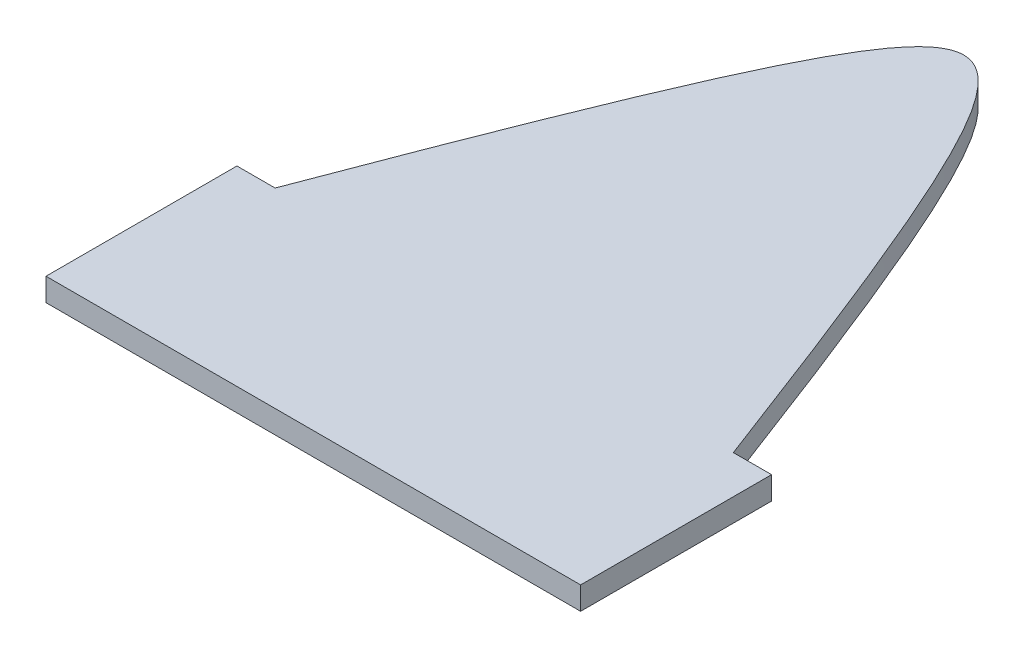
ISO-10303-21;
HEADER;
FILE_DESCRIPTION(('STEP AP214'),'2;1');
FILE_NAME('part.step','',(''),(''),'','','');
FILE_SCHEMA(('AUTOMOTIVE_DESIGN { 1 0 10303 214 1 1 1 1 }'));
ENDSEC;
DATA;
#1=APPLICATION_CONTEXT('core data for automotive mechanical design processes');
#2=APPLICATION_PROTOCOL_DEFINITION('international standard','automotive_design',2000,#1);
#3=PRODUCT_CONTEXT('',#1,'mechanical');
#4=PRODUCT('Part','Part','',(#3));
#5=PRODUCT_RELATED_PRODUCT_CATEGORY('part','',(#4));
#6=PRODUCT_DEFINITION_FORMATION('','',#4);
#7=PRODUCT_DEFINITION_CONTEXT('part definition',#1,'design');
#8=PRODUCT_DEFINITION('design','',#6,#7);
#9=PRODUCT_DEFINITION_SHAPE('','',#8);
#10=(LENGTH_UNIT() NAMED_UNIT(*) SI_UNIT(.MILLI.,.METRE.));
#11=(NAMED_UNIT(*) PLANE_ANGLE_UNIT() SI_UNIT($,.RADIAN.));
#12=(NAMED_UNIT(*) SI_UNIT($,.STERADIAN.) SOLID_ANGLE_UNIT());
#13=UNCERTAINTY_MEASURE_WITH_UNIT(LENGTH_MEASURE(1.E-05),#10,'distance_accuracy_value','');
#14=(GEOMETRIC_REPRESENTATION_CONTEXT(3) GLOBAL_UNCERTAINTY_ASSIGNED_CONTEXT((#13)) GLOBAL_UNIT_ASSIGNED_CONTEXT((#10,
#11,#12)) REPRESENTATION_CONTEXT('',''));
#15=CARTESIAN_POINT('',(0.,0.,0.));
#16=DIRECTION('',(0.,0.,1.));
#17=DIRECTION('',(1.,0.,0.));
#18=AXIS2_PLACEMENT_3D('',#15,#16,#17);
#19=CARTESIAN_POINT('',(30.,-3.,0.));
#20=CARTESIAN_POINT('',(0.,-3.,-79.6774759685465));
#21=CARTESIAN_POINT('',(-30.,-3.,0.));
#22=(BOUNDED_CURVE() B_SPLINE_CURVE(2,(#19,#20,#21),.UNSPECIFIED.,.F.,
.F.) B_SPLINE_CURVE_WITH_KNOTS((3,3),(0.,1.),
.UNSPECIFIED.) CURVE() GEOMETRIC_REPRESENTATION_ITEM() RATIONAL_B_SPLINE_CURVE((1.,
3.08339946566779,1.)) REPRESENTATION_ITEM(''));
#23=DIRECTION('',(0.,1.,0.));
#24=VECTOR('',#23,1.);
#25=SURFACE_OF_LINEAR_EXTRUSION('',#22,#24);
#26=CARTESIAN_POINT('',(30.,0.,0.));
#27=CARTESIAN_POINT('',(0.,0.,-79.6774759685465));
#28=CARTESIAN_POINT('',(-30.,0.,0.));
#29=(BOUNDED_CURVE() B_SPLINE_CURVE(2,(#26,#27,#28),.UNSPECIFIED.,.F.,
.F.) B_SPLINE_CURVE_WITH_KNOTS((3,3),(0.,1.),
.UNSPECIFIED.) CURVE() GEOMETRIC_REPRESENTATION_ITEM() RATIONAL_B_SPLINE_CURVE((1.,
3.08339946566779,1.)) REPRESENTATION_ITEM(''));
#30=CARTESIAN_POINT('',(30.,0.,0.));
#31=VERTEX_POINT('',#30);
#32=CARTESIAN_POINT('',(-30.,0.,0.));
#33=VERTEX_POINT('',#32);
#34=EDGE_CURVE('E121',#31,#33,#29,.T.);
#35=ORIENTED_EDGE('',*,*,#34,.F.);
#36=DIRECTION('',(0.,1.,0.));
#37=VECTOR('',#36,1.);
#38=CARTESIAN_POINT('',(30.,-3.,0.));
#39=LINE('',#38,#37);
#40=CARTESIAN_POINT('',(30.,-3.,0.));
#41=VERTEX_POINT('',#40);
#42=EDGE_CURVE('E11',#41,#31,#39,.T.);
#43=ORIENTED_EDGE('',*,*,#42,.F.);
#44=CARTESIAN_POINT('',(-30.,-3.,0.));
#45=VERTEX_POINT('',#44);
#46=EDGE_CURVE('E140',#41,#45,#22,.T.);
#47=ORIENTED_EDGE('',*,*,#46,.T.);
#48=DIRECTION('',(0.,1.,0.));
#49=VECTOR('',#48,1.);
#50=CARTESIAN_POINT('',(-30.,-3.,0.));
#51=LINE('',#50,#49);
#52=EDGE_CURVE('E39',#45,#33,#51,.T.);
#53=ORIENTED_EDGE('',*,*,#52,.T.);
#54=EDGE_LOOP('',(#35,#43,#47,#53));
#55=FACE_BOUND('',#54,.T.);
#56=ADVANCED_FACE('F35',(#55),#25,.T.);
#57=CARTESIAN_POINT('',(35.,-3.,0.));
#58=DIRECTION('',(0.,0.,-1.));
#59=DIRECTION('',(-1.,0.,0.));
#60=AXIS2_PLACEMENT_3D('',#57,#58,#59);
#61=PLANE('',#60);
#62=DIRECTION('',(-1.,0.,0.));
#63=VECTOR('',#62,1.);
#64=CARTESIAN_POINT('',(35.,0.,0.));
#65=LINE('',#64,#63);
#66=CARTESIAN_POINT('',(35.,0.,0.));
#67=VERTEX_POINT('',#66);
#68=EDGE_CURVE('E138',#67,#31,#65,.T.);
#69=ORIENTED_EDGE('',*,*,#68,.F.);
#70=DIRECTION('',(0.,1.,0.));
#71=VECTOR('',#70,1.);
#72=CARTESIAN_POINT('',(35.,-3.,0.));
#73=LINE('',#72,#71);
#74=CARTESIAN_POINT('',(35.,-3.,0.));
#75=VERTEX_POINT('',#74);
#76=EDGE_CURVE('E45',#75,#67,#73,.T.);
#77=ORIENTED_EDGE('',*,*,#76,.F.);
#78=DIRECTION('',(-1.,0.,0.));
#79=VECTOR('',#78,1.);
#80=CARTESIAN_POINT('',(35.,-3.,0.));
#81=LINE('',#80,#79);
#82=EDGE_CURVE('E111',#75,#41,#81,.T.);
#83=ORIENTED_EDGE('',*,*,#82,.T.);
#84=ORIENTED_EDGE('',*,*,#42,.T.);
#85=EDGE_LOOP('',(#69,#77,#83,#84));
#86=FACE_BOUND('',#85,.T.);
#87=ADVANCED_FACE('F148',(#86),#61,.T.);
#88=CARTESIAN_POINT('',(35.,-3.,25.));
#89=DIRECTION('',(1.,0.,0.));
#90=DIRECTION('',(0.,0.,-1.));
#91=AXIS2_PLACEMENT_3D('',#88,#89,#90);
#92=PLANE('',#91);
#93=DIRECTION('',(0.,0.,-1.));
#94=VECTOR('',#93,1.);
#95=CARTESIAN_POINT('',(35.,0.,25.));
#96=LINE('',#95,#94);
#97=CARTESIAN_POINT('',(35.,0.,25.));
#98=VERTEX_POINT('',#97);
#99=EDGE_CURVE('E98',#98,#67,#96,.T.);
#100=ORIENTED_EDGE('',*,*,#99,.F.);
#101=DIRECTION('',(0.,1.,0.));
#102=VECTOR('',#101,1.);
#103=CARTESIAN_POINT('',(35.,-3.,25.));
#104=LINE('',#103,#102);
#105=CARTESIAN_POINT('',(35.,-3.,25.));
#106=VERTEX_POINT('',#105);
#107=EDGE_CURVE('E93',#106,#98,#104,.T.);
#108=ORIENTED_EDGE('',*,*,#107,.F.);
#109=DIRECTION('',(0.,0.,-1.));
#110=VECTOR('',#109,1.);
#111=CARTESIAN_POINT('',(35.,-3.,25.));
#112=LINE('',#111,#110);
#113=EDGE_CURVE('E96',#106,#75,#112,.T.);
#114=ORIENTED_EDGE('',*,*,#113,.T.);
#115=ORIENTED_EDGE('',*,*,#76,.T.);
#116=EDGE_LOOP('',(#100,#108,#114,#115));
#117=FACE_BOUND('',#116,.T.);
#118=ADVANCED_FACE('F95',(#117),#92,.T.);
#119=CARTESIAN_POINT('',(-35.,-3.,25.));
#120=DIRECTION('',(0.,0.,1.));
#121=DIRECTION('',(1.,0.,0.));
#122=AXIS2_PLACEMENT_3D('',#119,#120,#121);
#123=PLANE('',#122);
#124=DIRECTION('',(1.,0.,0.));
#125=VECTOR('',#124,1.);
#126=CARTESIAN_POINT('',(-35.,0.,25.));
#127=LINE('',#126,#125);
#128=CARTESIAN_POINT('',(-35.,0.,25.));
#129=VERTEX_POINT('',#128);
#130=EDGE_CURVE('E135',#129,#98,#127,.T.);
#131=ORIENTED_EDGE('',*,*,#130,.F.);
#132=DIRECTION('',(0.,1.,0.));
#133=VECTOR('',#132,1.);
#134=CARTESIAN_POINT('',(-35.,-3.,25.));
#135=LINE('',#134,#133);
#136=CARTESIAN_POINT('',(-35.,-3.,25.));
#137=VERTEX_POINT('',#136);
#138=EDGE_CURVE('E103',#137,#129,#135,.T.);
#139=ORIENTED_EDGE('',*,*,#138,.F.);
#140=DIRECTION('',(1.,0.,0.));
#141=VECTOR('',#140,1.);
#142=CARTESIAN_POINT('',(-35.,-3.,25.));
#143=LINE('',#142,#141);
#144=EDGE_CURVE('E109',#137,#106,#143,.T.);
#145=ORIENTED_EDGE('',*,*,#144,.T.);
#146=ORIENTED_EDGE('',*,*,#107,.T.);
#147=EDGE_LOOP('',(#131,#139,#145,#146));
#148=FACE_BOUND('',#147,.T.);
#149=ADVANCED_FACE('F113',(#148),#123,.T.);
#150=CARTESIAN_POINT('',(-35.,-3.,0.));
#151=DIRECTION('',(-1.,0.,0.));
#152=DIRECTION('',(0.,0.,1.));
#153=AXIS2_PLACEMENT_3D('',#150,#151,#152);
#154=PLANE('',#153);
#155=DIRECTION('',(0.,0.,1.));
#156=VECTOR('',#155,1.);
#157=CARTESIAN_POINT('',(-35.,0.,0.));
#158=LINE('',#157,#156);
#159=CARTESIAN_POINT('',(-35.,0.,0.));
#160=VERTEX_POINT('',#159);
#161=EDGE_CURVE('E132',#160,#129,#158,.T.);
#162=ORIENTED_EDGE('',*,*,#161,.F.);
#163=DIRECTION('',(0.,1.,0.));
#164=VECTOR('',#163,1.);
#165=CARTESIAN_POINT('',(-35.,-3.,0.));
#166=LINE('',#165,#164);
#167=CARTESIAN_POINT('',(-35.,-3.,0.));
#168=VERTEX_POINT('',#167);
#169=EDGE_CURVE('E143',#168,#160,#166,.T.);
#170=ORIENTED_EDGE('',*,*,#169,.F.);
#171=DIRECTION('',(0.,0.,1.));
#172=VECTOR('',#171,1.);
#173=CARTESIAN_POINT('',(-35.,-3.,0.));
#174=LINE('',#173,#172);
#175=EDGE_CURVE('E114',#168,#137,#174,.T.);
#176=ORIENTED_EDGE('',*,*,#175,.T.);
#177=ORIENTED_EDGE('',*,*,#138,.T.);
#178=EDGE_LOOP('',(#162,#170,#176,#177));
#179=FACE_BOUND('',#178,.T.);
#180=ADVANCED_FACE('F161',(#179),#154,.T.);
#181=CARTESIAN_POINT('',(-30.,-3.,0.));
#182=DIRECTION('',(0.,0.,-1.));
#183=DIRECTION('',(-1.,0.,0.));
#184=AXIS2_PLACEMENT_3D('',#181,#182,#183);
#185=PLANE('',#184);
#186=DIRECTION('',(-1.,0.,0.));
#187=VECTOR('',#186,1.);
#188=CARTESIAN_POINT('',(-30.,0.,0.));
#189=LINE('',#188,#187);
#190=EDGE_CURVE('E126',#33,#160,#189,.T.);
#191=ORIENTED_EDGE('',*,*,#190,.F.);
#192=ORIENTED_EDGE('',*,*,#52,.F.);
#193=DIRECTION('',(-1.,0.,0.));
#194=VECTOR('',#193,1.);
#195=CARTESIAN_POINT('',(-30.,-3.,0.));
#196=LINE('',#195,#194);
#197=EDGE_CURVE('E116',#45,#168,#196,.T.);
#198=ORIENTED_EDGE('',*,*,#197,.T.);
#199=ORIENTED_EDGE('',*,*,#169,.T.);
#200=EDGE_LOOP('',(#191,#192,#198,#199));
#201=FACE_BOUND('',#200,.T.);
#202=ADVANCED_FACE('F145',(#201),#185,.T.);
#203=CARTESIAN_POINT('',(0.,-3.,-60.164940729598));
#204=DIRECTION('',(0.,1.,0.));
#205=DIRECTION('',(0.,0.,1.));
#206=AXIS2_PLACEMENT_3D('',#203,#204,#205);
#207=PLANE('',#206);
#208=ORIENTED_EDGE('',*,*,#46,.F.);
#209=ORIENTED_EDGE('',*,*,#82,.F.);
#210=ORIENTED_EDGE('',*,*,#113,.F.);
#211=ORIENTED_EDGE('',*,*,#144,.F.);
#212=ORIENTED_EDGE('',*,*,#175,.F.);
#213=ORIENTED_EDGE('',*,*,#197,.F.);
#214=EDGE_LOOP('',(#208,#209,#210,#211,#212,#213));
#215=FACE_BOUND('',#214,.T.);
#216=ADVANCED_FACE('F107',(#215),#207,.F.);
#217=CARTESIAN_POINT('',(0.,0.,-60.164940729598));
#218=DIRECTION('',(0.,1.,0.));
#219=DIRECTION('',(0.,0.,1.));
#220=AXIS2_PLACEMENT_3D('',#217,#218,#219);
#221=PLANE('',#220);
#222=ORIENTED_EDGE('',*,*,#34,.T.);
#223=ORIENTED_EDGE('',*,*,#190,.T.);
#224=ORIENTED_EDGE('',*,*,#161,.T.);
#225=ORIENTED_EDGE('',*,*,#130,.T.);
#226=ORIENTED_EDGE('',*,*,#99,.T.);
#227=ORIENTED_EDGE('',*,*,#68,.T.);
#228=EDGE_LOOP('',(#222,#223,#224,#225,#226,#227));
#229=FACE_BOUND('',#228,.T.);
#230=ADVANCED_FACE('F147',(#229),#221,.T.);
#231=CLOSED_SHELL('',(#56,#87,#118,#149,#180,#202,#216,#230));
#232=MANIFOLD_SOLID_BREP('B2',#231);
#233=ADVANCED_BREP_SHAPE_REPRESENTATION('',(#18,#232),#14);
#234=SHAPE_DEFINITION_REPRESENTATION(#9,#233);
ENDSEC;
END-ISO-10303-21;
